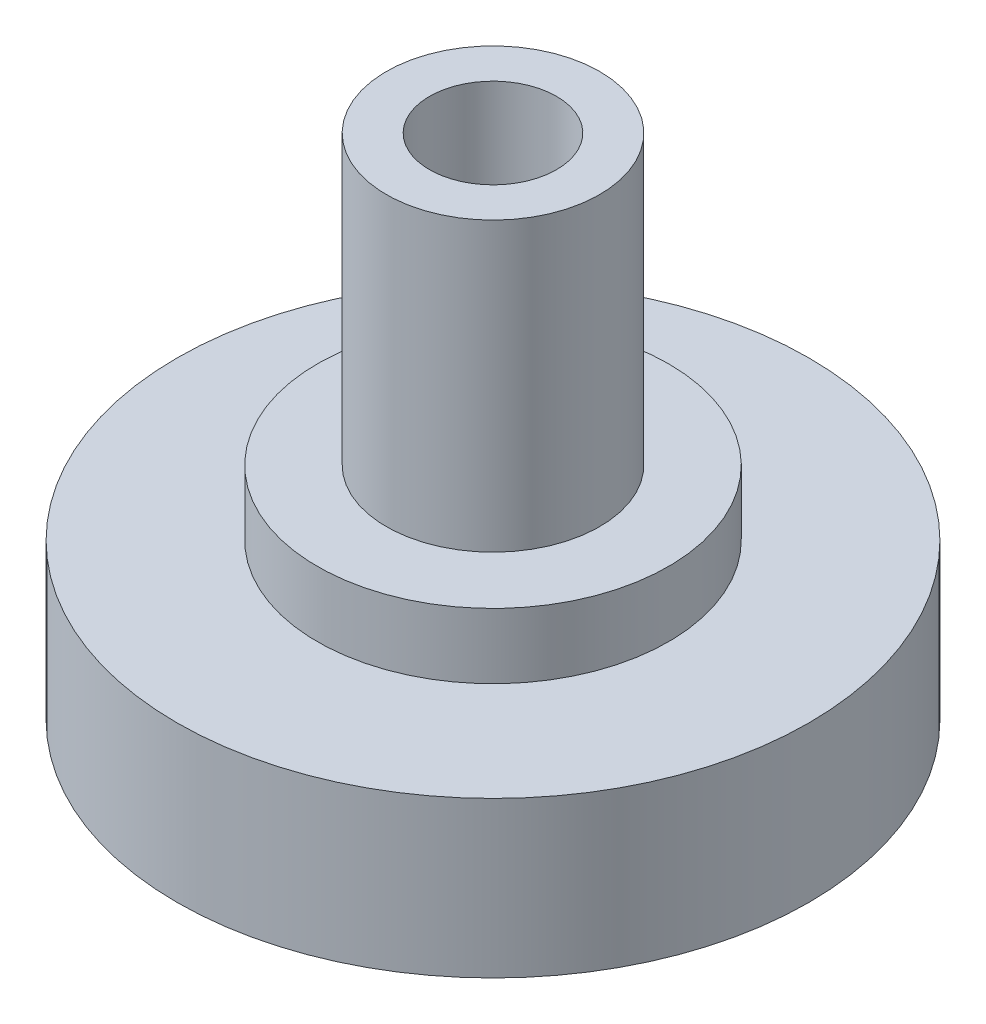
ISO-10303-21;
HEADER;
FILE_DESCRIPTION(('STEP AP214'),'2;1');
FILE_NAME('part.step','',(''),(''),'','','');
FILE_SCHEMA(('AUTOMOTIVE_DESIGN { 1 0 10303 214 1 1 1 1 }'));
ENDSEC;
DATA;
#1=APPLICATION_CONTEXT('core data for automotive mechanical design processes');
#2=APPLICATION_PROTOCOL_DEFINITION('international standard','automotive_design',2000,#1);
#3=PRODUCT_CONTEXT('',#1,'mechanical');
#4=PRODUCT('Part','Part','',(#3));
#5=PRODUCT_RELATED_PRODUCT_CATEGORY('part','',(#4));
#6=PRODUCT_DEFINITION_FORMATION('','',#4);
#7=PRODUCT_DEFINITION_CONTEXT('part definition',#1,'design');
#8=PRODUCT_DEFINITION('design','',#6,#7);
#9=PRODUCT_DEFINITION_SHAPE('','',#8);
#10=(LENGTH_UNIT() NAMED_UNIT(*) SI_UNIT(.MILLI.,.METRE.));
#11=(NAMED_UNIT(*) PLANE_ANGLE_UNIT() SI_UNIT($,.RADIAN.));
#12=(NAMED_UNIT(*) SI_UNIT($,.STERADIAN.) SOLID_ANGLE_UNIT());
#13=UNCERTAINTY_MEASURE_WITH_UNIT(LENGTH_MEASURE(1.E-05),#10,'distance_accuracy_value','');
#14=(GEOMETRIC_REPRESENTATION_CONTEXT(3) GLOBAL_UNCERTAINTY_ASSIGNED_CONTEXT((#13)) GLOBAL_UNIT_ASSIGNED_CONTEXT((#10,
#11,#12)) REPRESENTATION_CONTEXT('',''));
#15=CARTESIAN_POINT('',(0.,0.,0.));
#16=DIRECTION('',(0.,0.,1.));
#17=DIRECTION('',(1.,0.,0.));
#18=AXIS2_PLACEMENT_3D('',#15,#16,#17);
#19=CARTESIAN_POINT('',(0.,0.,0.));
#20=DIRECTION('',(0.,-1.,0.));
#21=DIRECTION('',(0.,0.,-1.));
#22=AXIS2_PLACEMENT_3D('',#19,#20,#21);
#23=PLANE('',#22);
#24=CARTESIAN_POINT('',(0.,0.,0.));
#25=DIRECTION('',(0.,-1.,0.));
#26=DIRECTION('',(0.,0.,-1.));
#27=AXIS2_PLACEMENT_3D('',#24,#25,#26);
#28=CIRCLE('',#27,9.45);
#29=CARTESIAN_POINT('',(0.,0.,-9.45));
#30=VERTEX_POINT('',#29);
#31=EDGE_CURVE('E10',#30,#30,#28,.T.);
#32=ORIENTED_EDGE('',*,*,#31,.T.);
#33=EDGE_LOOP('',(#32));
#34=FACE_BOUND('',#33,.T.);
#35=ADVANCED_FACE('F37',(#34),#23,.T.);
#36=CARTESIAN_POINT('',(0.,0.,0.));
#37=DIRECTION('',(0.,-1.,0.));
#38=DIRECTION('',(0.,0.,-1.));
#39=AXIS2_PLACEMENT_3D('',#36,#37,#38);
#40=CYLINDRICAL_SURFACE('',#39,9.45);
#41=CARTESIAN_POINT('',(0.,4.65,0.));
#42=DIRECTION('',(0.,-1.,0.));
#43=DIRECTION('',(0.,0.,-1.));
#44=AXIS2_PLACEMENT_3D('',#41,#42,#43);
#45=CIRCLE('',#44,9.45);
#46=CARTESIAN_POINT('',(0.,4.65,-9.45));
#47=VERTEX_POINT('',#46);
#48=EDGE_CURVE('E44',#47,#47,#45,.T.);
#49=ORIENTED_EDGE('',*,*,#48,.T.);
#50=EDGE_LOOP('',(#49));
#51=FACE_BOUND('',#50,.T.);
#52=ORIENTED_EDGE('',*,*,#31,.F.);
#53=EDGE_LOOP('',(#52));
#54=FACE_BOUND('',#53,.T.);
#55=ADVANCED_FACE('F89',(#51,#54),#40,.T.);
#56=CARTESIAN_POINT('',(9.45,4.65,0.));
#57=DIRECTION('',(0.,1.,0.));
#58=DIRECTION('',(0.,0.,1.));
#59=AXIS2_PLACEMENT_3D('',#56,#57,#58);
#60=PLANE('',#59);
#61=CARTESIAN_POINT('',(0.,4.65,0.));
#62=DIRECTION('',(0.,-1.,0.));
#63=DIRECTION('',(0.,0.,-1.));
#64=AXIS2_PLACEMENT_3D('',#61,#62,#63);
#65=CIRCLE('',#64,5.25);
#66=CARTESIAN_POINT('',(0.,4.65,-5.25));
#67=VERTEX_POINT('',#66);
#68=EDGE_CURVE('E49',#67,#67,#65,.T.);
#69=ORIENTED_EDGE('',*,*,#68,.T.);
#70=EDGE_LOOP('',(#69));
#71=FACE_BOUND('',#70,.T.);
#72=ORIENTED_EDGE('',*,*,#48,.F.);
#73=EDGE_LOOP('',(#72));
#74=FACE_BOUND('',#73,.T.);
#75=ADVANCED_FACE('F93',(#71,#74),#60,.T.);
#76=CARTESIAN_POINT('',(0.,0.,0.));
#77=DIRECTION('',(0.,-1.,0.));
#78=DIRECTION('',(0.,0.,-1.));
#79=AXIS2_PLACEMENT_3D('',#76,#77,#78);
#80=CYLINDRICAL_SURFACE('',#79,5.25);
#81=CARTESIAN_POINT('',(0.,6.6,0.));
#82=DIRECTION('',(0.,-1.,0.));
#83=DIRECTION('',(0.,0.,-1.));
#84=AXIS2_PLACEMENT_3D('',#81,#82,#83);
#85=CIRCLE('',#84,5.25);
#86=CARTESIAN_POINT('',(0.,6.6,-5.25));
#87=VERTEX_POINT('',#86);
#88=EDGE_CURVE('E54',#87,#87,#85,.T.);
#89=ORIENTED_EDGE('',*,*,#88,.T.);
#90=EDGE_LOOP('',(#89));
#91=FACE_BOUND('',#90,.T.);
#92=ORIENTED_EDGE('',*,*,#68,.F.);
#93=EDGE_LOOP('',(#92));
#94=FACE_BOUND('',#93,.T.);
#95=ADVANCED_FACE('F97',(#91,#94),#80,.T.);
#96=CARTESIAN_POINT('',(5.25,6.6,0.));
#97=DIRECTION('',(0.,1.,0.));
#98=DIRECTION('',(0.,0.,1.));
#99=AXIS2_PLACEMENT_3D('',#96,#97,#98);
#100=PLANE('',#99);
#101=CARTESIAN_POINT('',(0.,6.6,0.));
#102=DIRECTION('',(0.,-1.,0.));
#103=DIRECTION('',(0.,0.,-1.));
#104=AXIS2_PLACEMENT_3D('',#101,#102,#103);
#105=CIRCLE('',#104,3.19);
#106=CARTESIAN_POINT('',(0.,6.6,-3.19));
#107=VERTEX_POINT('',#106);
#108=EDGE_CURVE('E60',#107,#107,#105,.T.);
#109=ORIENTED_EDGE('',*,*,#108,.T.);
#110=EDGE_LOOP('',(#109));
#111=FACE_BOUND('',#110,.T.);
#112=ORIENTED_EDGE('',*,*,#88,.F.);
#113=EDGE_LOOP('',(#112));
#114=FACE_BOUND('',#113,.T.);
#115=ADVANCED_FACE('F104',(#111,#114),#100,.T.);
#116=CARTESIAN_POINT('',(0.,0.,0.));
#117=DIRECTION('',(0.,-1.,0.));
#118=DIRECTION('',(0.,0.,-1.));
#119=AXIS2_PLACEMENT_3D('',#116,#117,#118);
#120=CYLINDRICAL_SURFACE('',#119,3.19);
#121=CARTESIAN_POINT('',(0.,15.2,0.));
#122=DIRECTION('',(0.,-1.,0.));
#123=DIRECTION('',(0.,0.,-1.));
#124=AXIS2_PLACEMENT_3D('',#121,#122,#123);
#125=CIRCLE('',#124,3.19);
#126=CARTESIAN_POINT('',(0.,15.2,-3.19));
#127=VERTEX_POINT('',#126);
#128=EDGE_CURVE('E64',#127,#127,#125,.T.);
#129=ORIENTED_EDGE('',*,*,#128,.T.);
#130=EDGE_LOOP('',(#129));
#131=FACE_BOUND('',#130,.T.);
#132=ORIENTED_EDGE('',*,*,#108,.F.);
#133=EDGE_LOOP('',(#132));
#134=FACE_BOUND('',#133,.T.);
#135=ADVANCED_FACE('F108',(#131,#134),#120,.T.);
#136=CARTESIAN_POINT('',(3.19,15.2,0.));
#137=DIRECTION('',(0.,1.,0.));
#138=DIRECTION('',(0.,0.,1.));
#139=AXIS2_PLACEMENT_3D('',#136,#137,#138);
#140=PLANE('',#139);
#141=CARTESIAN_POINT('',(0.,15.2,0.));
#142=DIRECTION('',(0.,-1.,0.));
#143=DIRECTION('',(0.,0.,-1.));
#144=AXIS2_PLACEMENT_3D('',#141,#142,#143);
#145=CIRCLE('',#144,1.9);
#146=CARTESIAN_POINT('',(0.,15.2,-1.9));
#147=VERTEX_POINT('',#146);
#148=EDGE_CURVE('E68',#147,#147,#145,.T.);
#149=ORIENTED_EDGE('',*,*,#148,.T.);
#150=EDGE_LOOP('',(#149));
#151=FACE_BOUND('',#150,.T.);
#152=ORIENTED_EDGE('',*,*,#128,.F.);
#153=EDGE_LOOP('',(#152));
#154=FACE_BOUND('',#153,.T.);
#155=ADVANCED_FACE('F86',(#151,#154),#140,.T.);
#156=CARTESIAN_POINT('',(0.,0.,0.));
#157=DIRECTION('',(0.,-1.,0.));
#158=DIRECTION('',(0.,0.,-1.));
#159=AXIS2_PLACEMENT_3D('',#156,#157,#158);
#160=CYLINDRICAL_SURFACE('',#159,1.9);
#161=CARTESIAN_POINT('',(0.,10.2,0.));
#162=DIRECTION('',(0.,-1.,0.));
#163=DIRECTION('',(0.,0.,-1.));
#164=AXIS2_PLACEMENT_3D('',#161,#162,#163);
#165=CIRCLE('',#164,1.9);
#166=CARTESIAN_POINT('',(0.,10.2,-1.9));
#167=VERTEX_POINT('',#166);
#168=EDGE_CURVE('E72',#167,#167,#165,.T.);
#169=ORIENTED_EDGE('',*,*,#168,.T.);
#170=EDGE_LOOP('',(#169));
#171=FACE_BOUND('',#170,.T.);
#172=ORIENTED_EDGE('',*,*,#148,.F.);
#173=EDGE_LOOP('',(#172));
#174=FACE_BOUND('',#173,.T.);
#175=ADVANCED_FACE('F77',(#171,#174),#160,.F.);
#176=CARTESIAN_POINT('',(1.9,10.2,0.));
#177=DIRECTION('',(0.,1.,0.));
#178=DIRECTION('',(0.,0.,1.));
#179=AXIS2_PLACEMENT_3D('',#176,#177,#178);
#180=PLANE('',#179);
#181=ORIENTED_EDGE('',*,*,#168,.F.);
#182=EDGE_LOOP('',(#181));
#183=FACE_BOUND('',#182,.T.);
#184=ADVANCED_FACE('F80',(#183),#180,.T.);
#185=CLOSED_SHELL('',(#35,#55,#75,#95,#115,#135,#155,#175,#184));
#186=MANIFOLD_SOLID_BREP('B2',#185);
#187=ADVANCED_BREP_SHAPE_REPRESENTATION('',(#18,#186),#14);
#188=SHAPE_DEFINITION_REPRESENTATION(#9,#187);
ENDSEC;
END-ISO-10303-21;
